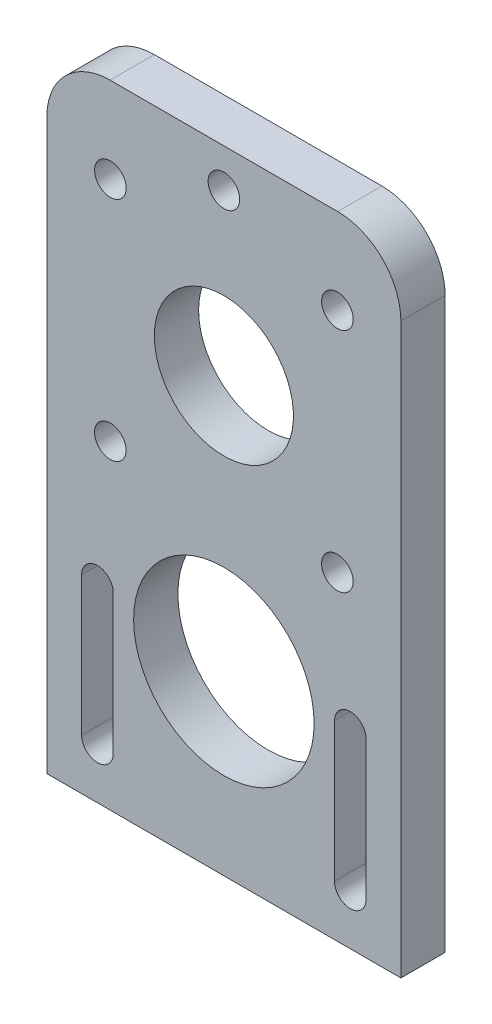
ISO-10303-21;
HEADER;
FILE_DESCRIPTION(('STEP AP214'),'2;1');
FILE_NAME('part.step','',(''),(''),'','','');
FILE_SCHEMA(('AUTOMOTIVE_DESIGN { 1 0 10303 214 1 1 1 1 }'));
ENDSEC;
DATA;
#1=APPLICATION_CONTEXT('core data for automotive mechanical design processes');
#2=APPLICATION_PROTOCOL_DEFINITION('international standard','automotive_design',2000,#1);
#3=PRODUCT_CONTEXT('',#1,'mechanical');
#4=PRODUCT('Part','Part','',(#3));
#5=PRODUCT_RELATED_PRODUCT_CATEGORY('part','',(#4));
#6=PRODUCT_DEFINITION_FORMATION('','',#4);
#7=PRODUCT_DEFINITION_CONTEXT('part definition',#1,'design');
#8=PRODUCT_DEFINITION('design','',#6,#7);
#9=PRODUCT_DEFINITION_SHAPE('','',#8);
#10=(LENGTH_UNIT() NAMED_UNIT(*) SI_UNIT(.MILLI.,.METRE.));
#11=(NAMED_UNIT(*) PLANE_ANGLE_UNIT() SI_UNIT($,.RADIAN.));
#12=(NAMED_UNIT(*) SI_UNIT($,.STERADIAN.) SOLID_ANGLE_UNIT());
#13=UNCERTAINTY_MEASURE_WITH_UNIT(LENGTH_MEASURE(1.E-05),#10,'distance_accuracy_value','');
#14=(GEOMETRIC_REPRESENTATION_CONTEXT(3) GLOBAL_UNCERTAINTY_ASSIGNED_CONTEXT((#13)) GLOBAL_UNIT_ASSIGNED_CONTEXT((#10,
#11,#12)) REPRESENTATION_CONTEXT('',''));
#15=CARTESIAN_POINT('',(0.,0.,0.));
#16=DIRECTION('',(0.,0.,1.));
#17=DIRECTION('',(1.,0.,0.));
#18=AXIS2_PLACEMENT_3D('',#15,#16,#17);
#19=CARTESIAN_POINT('',(0.,0.,7.));
#20=DIRECTION('',(-1.,0.,0.));
#21=DIRECTION('',(0.,0.,1.));
#22=AXIS2_PLACEMENT_3D('',#19,#20,#21);
#23=PLANE('',#22);
#24=DIRECTION('',(0.,1.,0.));
#25=VECTOR('',#24,1.);
#26=CARTESIAN_POINT('',(0.,0.,7.));
#27=LINE('',#26,#25);
#28=CARTESIAN_POINT('',(0.,0.,7.));
#29=VERTEX_POINT('',#28);
#30=CARTESIAN_POINT('',(0.,90.,7.));
#31=VERTEX_POINT('',#30);
#32=EDGE_CURVE('E230',#29,#31,#27,.T.);
#33=ORIENTED_EDGE('',*,*,#32,.T.);
#34=DIRECTION('',(0.,0.,-1.));
#35=VECTOR('',#34,1.);
#36=CARTESIAN_POINT('',(0.,90.,7.));
#37=LINE('',#36,#35);
#38=CARTESIAN_POINT('',(0.,90.,0.));
#39=VERTEX_POINT('',#38);
#40=EDGE_CURVE('E11',#31,#39,#37,.T.);
#41=ORIENTED_EDGE('',*,*,#40,.T.);
#42=DIRECTION('',(0.,1.,0.));
#43=VECTOR('',#42,1.);
#44=CARTESIAN_POINT('',(0.,0.,0.));
#45=LINE('',#44,#43);
#46=CARTESIAN_POINT('',(0.,0.,0.));
#47=VERTEX_POINT('',#46);
#48=EDGE_CURVE('E227',#47,#39,#45,.T.);
#49=ORIENTED_EDGE('',*,*,#48,.F.);
#50=DIRECTION('',(0.,0.,-1.));
#51=VECTOR('',#50,1.);
#52=CARTESIAN_POINT('',(0.,0.,7.));
#53=LINE('',#52,#51);
#54=EDGE_CURVE('E247',#29,#47,#53,.T.);
#55=ORIENTED_EDGE('',*,*,#54,.F.);
#56=EDGE_LOOP('',(#33,#41,#49,#55));
#57=FACE_BOUND('',#56,.T.);
#58=ADVANCED_FACE('F44',(#57),#23,.T.);
#59=CARTESIAN_POINT('',(0.,0.,7.));
#60=DIRECTION('',(0.,1.,0.));
#61=DIRECTION('',(0.,0.,1.));
#62=AXIS2_PLACEMENT_3D('',#59,#60,#61);
#63=PLANE('',#62);
#64=DIRECTION('',(1.,0.,0.));
#65=VECTOR('',#64,1.);
#66=CARTESIAN_POINT('',(0.,0.,0.));
#67=LINE('',#66,#65);
#68=CARTESIAN_POINT('',(56.,0.,0.));
#69=VERTEX_POINT('',#68);
#70=EDGE_CURVE('E235',#47,#69,#67,.T.);
#71=ORIENTED_EDGE('',*,*,#70,.T.);
#72=DIRECTION('',(0.,0.,-1.));
#73=VECTOR('',#72,1.);
#74=CARTESIAN_POINT('',(56.,0.,7.));
#75=LINE('',#74,#73);
#76=CARTESIAN_POINT('',(56.,0.,7.));
#77=VERTEX_POINT('',#76);
#78=EDGE_CURVE('E237',#77,#69,#75,.T.);
#79=ORIENTED_EDGE('',*,*,#78,.F.);
#80=DIRECTION('',(1.,0.,0.));
#81=VECTOR('',#80,1.);
#82=CARTESIAN_POINT('',(0.,0.,7.));
#83=LINE('',#82,#81);
#84=EDGE_CURVE('E240',#29,#77,#83,.T.);
#85=ORIENTED_EDGE('',*,*,#84,.F.);
#86=ORIENTED_EDGE('',*,*,#54,.T.);
#87=EDGE_LOOP('',(#71,#79,#85,#86));
#88=FACE_BOUND('',#87,.T.);
#89=ADVANCED_FACE('F280',(#88),#63,.F.);
#90=CARTESIAN_POINT('',(56.,0.,7.));
#91=DIRECTION('',(-1.,0.,0.));
#92=DIRECTION('',(0.,0.,1.));
#93=AXIS2_PLACEMENT_3D('',#90,#91,#92);
#94=PLANE('',#93);
#95=DIRECTION('',(0.,1.,0.));
#96=VECTOR('',#95,1.);
#97=CARTESIAN_POINT('',(56.,0.,0.));
#98=LINE('',#97,#96);
#99=CARTESIAN_POINT('',(56.,90.,0.));
#100=VERTEX_POINT('',#99);
#101=EDGE_CURVE('E244',#69,#100,#98,.T.);
#102=ORIENTED_EDGE('',*,*,#101,.T.);
#103=DIRECTION('',(0.,0.,-1.));
#104=VECTOR('',#103,1.);
#105=CARTESIAN_POINT('',(56.,90.,7.));
#106=LINE('',#105,#104);
#107=CARTESIAN_POINT('',(56.,90.,7.));
#108=VERTEX_POINT('',#107);
#109=EDGE_CURVE('E68',#100,#108,#106,.F.);
#110=ORIENTED_EDGE('',*,*,#109,.T.);
#111=DIRECTION('',(0.,1.,0.));
#112=VECTOR('',#111,1.);
#113=CARTESIAN_POINT('',(56.,0.,7.));
#114=LINE('',#113,#112);
#115=EDGE_CURVE('E232',#77,#108,#114,.T.);
#116=ORIENTED_EDGE('',*,*,#115,.F.);
#117=ORIENTED_EDGE('',*,*,#78,.T.);
#118=EDGE_LOOP('',(#102,#110,#116,#117));
#119=FACE_BOUND('',#118,.T.);
#120=ADVANCED_FACE('F274',(#119),#94,.F.);
#121=CARTESIAN_POINT('',(0.,100.,7.));
#122=DIRECTION('',(0.,1.,0.));
#123=DIRECTION('',(0.,0.,1.));
#124=AXIS2_PLACEMENT_3D('',#121,#122,#123);
#125=PLANE('',#124);
#126=DIRECTION('',(1.,0.,0.));
#127=VECTOR('',#126,1.);
#128=CARTESIAN_POINT('',(0.,100.,7.));
#129=LINE('',#128,#127);
#130=CARTESIAN_POINT('',(10.,100.,7.));
#131=VERTEX_POINT('',#130);
#132=CARTESIAN_POINT('',(46.,100.,7.));
#133=VERTEX_POINT('',#132);
#134=EDGE_CURVE('E233',#131,#133,#129,.T.);
#135=ORIENTED_EDGE('',*,*,#134,.T.);
#136=DIRECTION('',(0.,0.,-1.));
#137=VECTOR('',#136,1.);
#138=CARTESIAN_POINT('',(46.,100.,0.));
#139=LINE('',#138,#137);
#140=CARTESIAN_POINT('',(46.,100.,0.));
#141=VERTEX_POINT('',#140);
#142=EDGE_CURVE('E251',#133,#141,#139,.T.);
#143=ORIENTED_EDGE('',*,*,#142,.T.);
#144=DIRECTION('',(1.,0.,0.));
#145=VECTOR('',#144,1.);
#146=CARTESIAN_POINT('',(0.,100.,0.));
#147=LINE('',#146,#145);
#148=CARTESIAN_POINT('',(10.,100.,0.));
#149=VERTEX_POINT('',#148);
#150=EDGE_CURVE('E245',#149,#141,#147,.T.);
#151=ORIENTED_EDGE('',*,*,#150,.F.);
#152=DIRECTION('',(0.,0.,-1.));
#153=VECTOR('',#152,1.);
#154=CARTESIAN_POINT('',(10.,100.,7.));
#155=LINE('',#154,#153);
#156=EDGE_CURVE('E249',#149,#131,#155,.F.);
#157=ORIENTED_EDGE('',*,*,#156,.T.);
#158=EDGE_LOOP('',(#135,#143,#151,#157));
#159=FACE_BOUND('',#158,.T.);
#160=ADVANCED_FACE('F267',(#159),#125,.T.);
#161=CARTESIAN_POINT('',(0.,0.,7.));
#162=DIRECTION('',(0.,0.,-1.));
#163=DIRECTION('',(-1.,0.,0.));
#164=AXIS2_PLACEMENT_3D('',#161,#162,#163);
#165=PLANE('',#164);
#166=CARTESIAN_POINT('',(10.0340180617316,50.5449591202412,7.));
#167=DIRECTION('',(0.,0.,-1.));
#168=DIRECTION('',(-1.,0.,0.));
#169=AXIS2_PLACEMENT_3D('',#166,#167,#168);
#170=CIRCLE('',#169,2.5);
#171=CARTESIAN_POINT('',(7.53401806173156,50.5449591202412,7.));
#172=VERTEX_POINT('',#171);
#173=EDGE_CURVE('E391',#172,#172,#170,.T.);
#174=ORIENTED_EDGE('',*,*,#173,.T.);
#175=EDGE_LOOP('',(#174));
#176=FACE_BOUND('',#175,.T.);
#177=CARTESIAN_POINT('',(45.9550408797589,50.5340180617316,7.));
#178=DIRECTION('',(0.,0.,-1.));
#179=DIRECTION('',(-1.,0.,0.));
#180=AXIS2_PLACEMENT_3D('',#177,#178,#179);
#181=CIRCLE('',#180,2.5);
#182=CARTESIAN_POINT('',(43.4550408797589,50.5340180617316,7.));
#183=VERTEX_POINT('',#182);
#184=EDGE_CURVE('E383',#183,#183,#181,.T.);
#185=ORIENTED_EDGE('',*,*,#184,.T.);
#186=EDGE_LOOP('',(#185));
#187=FACE_BOUND('',#186,.T.);
#188=CARTESIAN_POINT('',(10.0449591202411,86.4659819382685,7.));
#189=DIRECTION('',(0.,0.,-1.));
#190=DIRECTION('',(-1.,0.,0.));
#191=AXIS2_PLACEMENT_3D('',#188,#189,#190);
#192=CIRCLE('',#191,2.5);
#193=CARTESIAN_POINT('',(7.54495912024114,86.4659819382685,7.));
#194=VERTEX_POINT('',#193);
#195=EDGE_CURVE('E378',#194,#194,#192,.T.);
#196=ORIENTED_EDGE('',*,*,#195,.T.);
#197=EDGE_LOOP('',(#196));
#198=FACE_BOUND('',#197,.T.);
#199=CARTESIAN_POINT('',(28.0077364966655,93.8999988217838,7.));
#200=DIRECTION('',(0.,0.,-1.));
#201=DIRECTION('',(-1.,0.,0.));
#202=AXIS2_PLACEMENT_3D('',#199,#200,#201);
#203=CIRCLE('',#202,2.5);
#204=CARTESIAN_POINT('',(25.5077364966655,93.8999988217838,7.));
#205=VERTEX_POINT('',#204);
#206=EDGE_CURVE('E364',#205,#205,#203,.T.);
#207=ORIENTED_EDGE('',*,*,#206,.T.);
#208=EDGE_LOOP('',(#207));
#209=FACE_BOUND('',#208,.T.);
#210=CARTESIAN_POINT('',(45.9659819382684,86.4550408797589,7.));
#211=DIRECTION('',(0.,0.,-1.));
#212=DIRECTION('',(-1.,0.,0.));
#213=AXIS2_PLACEMENT_3D('',#210,#211,#212);
#214=CIRCLE('',#213,2.5);
#215=CARTESIAN_POINT('',(43.4659819382684,86.4550408797589,7.));
#216=VERTEX_POINT('',#215);
#217=EDGE_CURVE('E375',#216,#216,#214,.T.);
#218=ORIENTED_EDGE('',*,*,#217,.T.);
#219=EDGE_LOOP('',(#218));
#220=FACE_BOUND('',#219,.T.);
#221=CARTESIAN_POINT('',(28.,68.5,7.));
#222=DIRECTION('',(0.,0.,-1.));
#223=DIRECTION('',(-1.,0.,0.));
#224=AXIS2_PLACEMENT_3D('',#221,#222,#223);
#225=CIRCLE('',#224,11.);
#226=CARTESIAN_POINT('',(17.,68.5,7.));
#227=VERTEX_POINT('',#226);
#228=EDGE_CURVE('E204',#227,#227,#225,.T.);
#229=ORIENTED_EDGE('',*,*,#228,.T.);
#230=EDGE_LOOP('',(#229));
#231=FACE_BOUND('',#230,.T.);
#232=DIRECTION('',(0.,-1.,0.));
#233=VECTOR('',#232,1.);
#234=CARTESIAN_POINT('',(45.5,30.,7.));
#235=LINE('',#234,#233);
#236=CARTESIAN_POINT('',(45.5,30.,7.));
#237=VERTEX_POINT('',#236);
#238=CARTESIAN_POINT('',(45.5,8.,7.));
#239=VERTEX_POINT('',#238);
#240=EDGE_CURVE('E211',#237,#239,#235,.T.);
#241=ORIENTED_EDGE('',*,*,#240,.F.);
#242=CARTESIAN_POINT('',(48.,30.,7.));
#243=DIRECTION('',(0.,0.,1.));
#244=DIRECTION('',(1.,0.,0.));
#245=AXIS2_PLACEMENT_3D('',#242,#243,#244);
#246=CIRCLE('',#245,2.5);
#247=CARTESIAN_POINT('',(50.5,30.,7.));
#248=VERTEX_POINT('',#247);
#249=EDGE_CURVE('E163',#248,#237,#246,.T.);
#250=ORIENTED_EDGE('',*,*,#249,.F.);
#251=DIRECTION('',(0.,1.,0.));
#252=VECTOR('',#251,1.);
#253=CARTESIAN_POINT('',(50.5,30.,7.));
#254=LINE('',#253,#252);
#255=CARTESIAN_POINT('',(50.5,8.,7.));
#256=VERTEX_POINT('',#255);
#257=EDGE_CURVE('E201',#256,#248,#254,.T.);
#258=ORIENTED_EDGE('',*,*,#257,.F.);
#259=CARTESIAN_POINT('',(48.,8.,7.));
#260=DIRECTION('',(0.,0.,1.));
#261=DIRECTION('',(1.,0.,0.));
#262=AXIS2_PLACEMENT_3D('',#259,#260,#261);
#263=CIRCLE('',#262,2.50000000000001);
#264=EDGE_CURVE('E206',#239,#256,#263,.T.);
#265=ORIENTED_EDGE('',*,*,#264,.F.);
#266=EDGE_LOOP('',(#241,#250,#258,#265));
#267=FACE_BOUND('',#266,.T.);
#268=DIRECTION('',(0.,-1.,0.));
#269=VECTOR('',#268,1.);
#270=CARTESIAN_POINT('',(5.5,30.,7.));
#271=LINE('',#270,#269);
#272=CARTESIAN_POINT('',(5.5,30.,7.));
#273=VERTEX_POINT('',#272);
#274=CARTESIAN_POINT('',(5.5,8.,7.));
#275=VERTEX_POINT('',#274);
#276=EDGE_CURVE('E174',#273,#275,#271,.T.);
#277=ORIENTED_EDGE('',*,*,#276,.F.);
#278=CARTESIAN_POINT('',(8.,30.,7.));
#279=DIRECTION('',(0.,0.,1.));
#280=DIRECTION('',(1.,0.,0.));
#281=AXIS2_PLACEMENT_3D('',#278,#279,#280);
#282=CIRCLE('',#281,2.5);
#283=CARTESIAN_POINT('',(10.5,30.,7.));
#284=VERTEX_POINT('',#283);
#285=EDGE_CURVE('E153',#284,#273,#282,.T.);
#286=ORIENTED_EDGE('',*,*,#285,.F.);
#287=DIRECTION('',(0.,1.,0.));
#288=VECTOR('',#287,1.);
#289=CARTESIAN_POINT('',(10.5,30.,7.));
#290=LINE('',#289,#288);
#291=CARTESIAN_POINT('',(10.5,8.,7.));
#292=VERTEX_POINT('',#291);
#293=EDGE_CURVE('E165',#292,#284,#290,.T.);
#294=ORIENTED_EDGE('',*,*,#293,.F.);
#295=CARTESIAN_POINT('',(8.,8.,7.));
#296=DIRECTION('',(0.,0.,1.));
#297=DIRECTION('',(1.,0.,0.));
#298=AXIS2_PLACEMENT_3D('',#295,#296,#297);
#299=CIRCLE('',#298,2.5);
#300=EDGE_CURVE('E169',#275,#292,#299,.T.);
#301=ORIENTED_EDGE('',*,*,#300,.F.);
#302=EDGE_LOOP('',(#277,#286,#294,#301));
#303=FACE_BOUND('',#302,.T.);
#304=CARTESIAN_POINT('',(28.,28.,7.));
#305=DIRECTION('',(0.,0.,1.));
#306=DIRECTION('',(1.,0.,0.));
#307=AXIS2_PLACEMENT_3D('',#304,#305,#306);
#308=CIRCLE('',#307,14.275);
#309=CARTESIAN_POINT('',(42.275,28.,7.));
#310=VERTEX_POINT('',#309);
#311=EDGE_CURVE('E176',#310,#310,#308,.T.);
#312=ORIENTED_EDGE('',*,*,#311,.F.);
#313=EDGE_LOOP('',(#312));
#314=FACE_BOUND('',#313,.T.);
#315=ORIENTED_EDGE('',*,*,#115,.T.);
#316=CARTESIAN_POINT('',(46.,90.,7.));
#317=DIRECTION('',(0.,0.,-1.));
#318=DIRECTION('',(-1.,0.,0.));
#319=AXIS2_PLACEMENT_3D('',#316,#317,#318);
#320=CIRCLE('',#319,10.);
#321=EDGE_CURVE('E52',#108,#133,#320,.F.);
#322=ORIENTED_EDGE('',*,*,#321,.T.);
#323=ORIENTED_EDGE('',*,*,#134,.F.);
#324=CARTESIAN_POINT('',(10.,90.,7.));
#325=DIRECTION('',(0.,0.,-1.));
#326=DIRECTION('',(-1.,0.,0.));
#327=AXIS2_PLACEMENT_3D('',#324,#325,#326);
#328=CIRCLE('',#327,10.);
#329=EDGE_CURVE('E58',#131,#31,#328,.F.);
#330=ORIENTED_EDGE('',*,*,#329,.T.);
#331=ORIENTED_EDGE('',*,*,#32,.F.);
#332=ORIENTED_EDGE('',*,*,#84,.T.);
#333=EDGE_LOOP('',(#315,#322,#323,#330,#331,#332));
#334=FACE_BOUND('',#333,.T.);
#335=ADVANCED_FACE('F175',(#176,#187,#198,#209,#220,#231,#267,#303,#314,#334),#165,.F.);
#336=CARTESIAN_POINT('',(0.,0.,0.));
#337=DIRECTION('',(0.,0.,-1.));
#338=DIRECTION('',(-1.,0.,0.));
#339=AXIS2_PLACEMENT_3D('',#336,#337,#338);
#340=PLANE('',#339);
#341=CARTESIAN_POINT('',(10.0340180617316,50.5449591202412,0.));
#342=DIRECTION('',(0.,0.,-1.));
#343=DIRECTION('',(-1.,0.,0.));
#344=AXIS2_PLACEMENT_3D('',#341,#342,#343);
#345=CIRCLE('',#344,2.5);
#346=CARTESIAN_POINT('',(7.53401806173156,50.5449591202412,0.));
#347=VERTEX_POINT('',#346);
#348=EDGE_CURVE('E390',#347,#347,#345,.T.);
#349=ORIENTED_EDGE('',*,*,#348,.F.);
#350=EDGE_LOOP('',(#349));
#351=FACE_BOUND('',#350,.T.);
#352=CARTESIAN_POINT('',(45.9550408797589,50.5340180617316,0.));
#353=DIRECTION('',(0.,0.,-1.));
#354=DIRECTION('',(-1.,0.,0.));
#355=AXIS2_PLACEMENT_3D('',#352,#353,#354);
#356=CIRCLE('',#355,2.5);
#357=CARTESIAN_POINT('',(43.4550408797589,50.5340180617316,0.));
#358=VERTEX_POINT('',#357);
#359=EDGE_CURVE('E385',#358,#358,#356,.T.);
#360=ORIENTED_EDGE('',*,*,#359,.F.);
#361=EDGE_LOOP('',(#360));
#362=FACE_BOUND('',#361,.T.);
#363=CARTESIAN_POINT('',(10.0449591202411,86.4659819382685,0.));
#364=DIRECTION('',(0.,0.,-1.));
#365=DIRECTION('',(-1.,0.,0.));
#366=AXIS2_PLACEMENT_3D('',#363,#364,#365);
#367=CIRCLE('',#366,2.5);
#368=CARTESIAN_POINT('',(7.54495912024114,86.4659819382685,0.));
#369=VERTEX_POINT('',#368);
#370=EDGE_CURVE('E372',#369,#369,#367,.T.);
#371=ORIENTED_EDGE('',*,*,#370,.F.);
#372=EDGE_LOOP('',(#371));
#373=FACE_BOUND('',#372,.T.);
#374=CARTESIAN_POINT('',(28.0077364966655,93.8999988217838,0.));
#375=DIRECTION('',(0.,0.,-1.));
#376=DIRECTION('',(-1.,0.,0.));
#377=AXIS2_PLACEMENT_3D('',#374,#375,#376);
#378=CIRCLE('',#377,2.5);
#379=CARTESIAN_POINT('',(25.5077364966655,93.8999988217838,0.));
#380=VERTEX_POINT('',#379);
#381=EDGE_CURVE('E370',#380,#380,#378,.T.);
#382=ORIENTED_EDGE('',*,*,#381,.F.);
#383=EDGE_LOOP('',(#382));
#384=FACE_BOUND('',#383,.T.);
#385=CARTESIAN_POINT('',(45.9659819382684,86.4550408797589,0.));
#386=DIRECTION('',(0.,0.,-1.));
#387=DIRECTION('',(-1.,0.,0.));
#388=AXIS2_PLACEMENT_3D('',#385,#386,#387);
#389=CIRCLE('',#388,2.5);
#390=CARTESIAN_POINT('',(43.4659819382684,86.4550408797589,0.));
#391=VERTEX_POINT('',#390);
#392=EDGE_CURVE('E367',#391,#391,#389,.T.);
#393=ORIENTED_EDGE('',*,*,#392,.F.);
#394=EDGE_LOOP('',(#393));
#395=FACE_BOUND('',#394,.T.);
#396=CARTESIAN_POINT('',(28.,68.5,0.));
#397=DIRECTION('',(0.,0.,-1.));
#398=DIRECTION('',(-1.,0.,0.));
#399=AXIS2_PLACEMENT_3D('',#396,#397,#398);
#400=CIRCLE('',#399,11.);
#401=CARTESIAN_POINT('',(17.,68.5,0.));
#402=VERTEX_POINT('',#401);
#403=EDGE_CURVE('E394',#402,#402,#400,.T.);
#404=ORIENTED_EDGE('',*,*,#403,.F.);
#405=EDGE_LOOP('',(#404));
#406=FACE_BOUND('',#405,.T.);
#407=CARTESIAN_POINT('',(48.,30.,0.));
#408=DIRECTION('',(0.,0.,1.));
#409=DIRECTION('',(1.,0.,0.));
#410=AXIS2_PLACEMENT_3D('',#407,#408,#409);
#411=CIRCLE('',#410,2.5);
#412=CARTESIAN_POINT('',(50.5,30.,0.));
#413=VERTEX_POINT('',#412);
#414=CARTESIAN_POINT('',(45.5,30.,0.));
#415=VERTEX_POINT('',#414);
#416=EDGE_CURVE('E209',#413,#415,#411,.T.);
#417=ORIENTED_EDGE('',*,*,#416,.T.);
#418=DIRECTION('',(0.,-1.,0.));
#419=VECTOR('',#418,1.);
#420=CARTESIAN_POINT('',(45.5,30.,0.));
#421=LINE('',#420,#419);
#422=CARTESIAN_POINT('',(45.5,8.,0.));
#423=VERTEX_POINT('',#422);
#424=EDGE_CURVE('E222',#415,#423,#421,.T.);
#425=ORIENTED_EDGE('',*,*,#424,.T.);
#426=CARTESIAN_POINT('',(48.,8.,0.));
#427=DIRECTION('',(0.,0.,1.));
#428=DIRECTION('',(1.,0.,0.));
#429=AXIS2_PLACEMENT_3D('',#426,#427,#428);
#430=CIRCLE('',#429,2.50000000000001);
#431=CARTESIAN_POINT('',(50.5,8.,0.));
#432=VERTEX_POINT('',#431);
#433=EDGE_CURVE('E218',#423,#432,#430,.T.);
#434=ORIENTED_EDGE('',*,*,#433,.T.);
#435=DIRECTION('',(0.,1.,0.));
#436=VECTOR('',#435,1.);
#437=CARTESIAN_POINT('',(50.5,30.,0.));
#438=LINE('',#437,#436);
#439=EDGE_CURVE('E200',#432,#413,#438,.T.);
#440=ORIENTED_EDGE('',*,*,#439,.T.);
#441=EDGE_LOOP('',(#417,#425,#434,#440));
#442=FACE_BOUND('',#441,.T.);
#443=CARTESIAN_POINT('',(8.,30.,0.));
#444=DIRECTION('',(0.,0.,1.));
#445=DIRECTION('',(1.,0.,0.));
#446=AXIS2_PLACEMENT_3D('',#443,#444,#445);
#447=CIRCLE('',#446,2.5);
#448=CARTESIAN_POINT('',(10.5,30.,0.));
#449=VERTEX_POINT('',#448);
#450=CARTESIAN_POINT('',(5.5,30.,0.));
#451=VERTEX_POINT('',#450);
#452=EDGE_CURVE('E157',#449,#451,#447,.T.);
#453=ORIENTED_EDGE('',*,*,#452,.T.);
#454=DIRECTION('',(0.,-1.,0.));
#455=VECTOR('',#454,1.);
#456=CARTESIAN_POINT('',(5.5,30.,0.));
#457=LINE('',#456,#455);
#458=CARTESIAN_POINT('',(5.5,8.,0.));
#459=VERTEX_POINT('',#458);
#460=EDGE_CURVE('E188',#451,#459,#457,.T.);
#461=ORIENTED_EDGE('',*,*,#460,.T.);
#462=CARTESIAN_POINT('',(8.,8.,0.));
#463=DIRECTION('',(0.,0.,1.));
#464=DIRECTION('',(1.,0.,0.));
#465=AXIS2_PLACEMENT_3D('',#462,#463,#464);
#466=CIRCLE('',#465,2.5);
#467=CARTESIAN_POINT('',(10.5,8.,0.));
#468=VERTEX_POINT('',#467);
#469=EDGE_CURVE('E187',#459,#468,#466,.T.);
#470=ORIENTED_EDGE('',*,*,#469,.T.);
#471=DIRECTION('',(0.,1.,0.));
#472=VECTOR('',#471,1.);
#473=CARTESIAN_POINT('',(10.5,30.,0.));
#474=LINE('',#473,#472);
#475=EDGE_CURVE('E183',#468,#449,#474,.T.);
#476=ORIENTED_EDGE('',*,*,#475,.T.);
#477=EDGE_LOOP('',(#453,#461,#470,#476));
#478=FACE_BOUND('',#477,.T.);
#479=CARTESIAN_POINT('',(28.,28.,0.));
#480=DIRECTION('',(0.,0.,1.));
#481=DIRECTION('',(1.,0.,0.));
#482=AXIS2_PLACEMENT_3D('',#479,#480,#481);
#483=CIRCLE('',#482,14.275);
#484=CARTESIAN_POINT('',(42.275,28.,0.));
#485=VERTEX_POINT('',#484);
#486=EDGE_CURVE('E177',#485,#485,#483,.T.);
#487=ORIENTED_EDGE('',*,*,#486,.T.);
#488=EDGE_LOOP('',(#487));
#489=FACE_BOUND('',#488,.T.);
#490=ORIENTED_EDGE('',*,*,#150,.T.);
#491=CARTESIAN_POINT('',(46.,90.,0.));
#492=DIRECTION('',(0.,0.,-1.));
#493=DIRECTION('',(-1.,0.,0.));
#494=AXIS2_PLACEMENT_3D('',#491,#492,#493);
#495=CIRCLE('',#494,10.);
#496=EDGE_CURVE('E258',#141,#100,#495,.T.);
#497=ORIENTED_EDGE('',*,*,#496,.T.);
#498=ORIENTED_EDGE('',*,*,#101,.F.);
#499=ORIENTED_EDGE('',*,*,#70,.F.);
#500=ORIENTED_EDGE('',*,*,#48,.T.);
#501=CARTESIAN_POINT('',(10.,90.,0.));
#502=DIRECTION('',(0.,0.,-1.));
#503=DIRECTION('',(-1.,0.,0.));
#504=AXIS2_PLACEMENT_3D('',#501,#502,#503);
#505=CIRCLE('',#504,10.);
#506=EDGE_CURVE('E256',#39,#149,#505,.T.);
#507=ORIENTED_EDGE('',*,*,#506,.T.);
#508=EDGE_LOOP('',(#490,#497,#498,#499,#500,#507));
#509=FACE_BOUND('',#508,.T.);
#510=ADVANCED_FACE('F275',(#351,#362,#373,#384,#395,#406,#442,#478,#489,#509),#340,.T.);
#511=CARTESIAN_POINT('',(28.,28.,0.));
#512=DIRECTION('',(0.,0.,1.));
#513=DIRECTION('',(1.,0.,0.));
#514=AXIS2_PLACEMENT_3D('',#511,#512,#513);
#515=CYLINDRICAL_SURFACE('',#514,14.275);
#516=ORIENTED_EDGE('',*,*,#486,.F.);
#517=EDGE_LOOP('',(#516));
#518=FACE_BOUND('',#517,.T.);
#519=ORIENTED_EDGE('',*,*,#311,.T.);
#520=EDGE_LOOP('',(#519));
#521=FACE_BOUND('',#520,.T.);
#522=ADVANCED_FACE('F305',(#518,#521),#515,.F.);
#523=CARTESIAN_POINT('',(8.,30.,0.));
#524=DIRECTION('',(0.,0.,1.));
#525=DIRECTION('',(1.,0.,0.));
#526=AXIS2_PLACEMENT_3D('',#523,#524,#525);
#527=CYLINDRICAL_SURFACE('',#526,2.5);
#528=ORIENTED_EDGE('',*,*,#285,.T.);
#529=DIRECTION('',(0.,0.,1.));
#530=VECTOR('',#529,1.);
#531=CARTESIAN_POINT('',(5.5,30.,0.));
#532=LINE('',#531,#530);
#533=EDGE_CURVE('E190',#451,#273,#532,.T.);
#534=ORIENTED_EDGE('',*,*,#533,.F.);
#535=ORIENTED_EDGE('',*,*,#452,.F.);
#536=DIRECTION('',(0.,0.,1.));
#537=VECTOR('',#536,1.);
#538=CARTESIAN_POINT('',(10.5,30.,0.));
#539=LINE('',#538,#537);
#540=EDGE_CURVE('E148',#449,#284,#539,.T.);
#541=ORIENTED_EDGE('',*,*,#540,.T.);
#542=EDGE_LOOP('',(#528,#534,#535,#541));
#543=FACE_BOUND('',#542,.T.);
#544=ADVANCED_FACE('F151',(#543),#527,.F.);
#545=CARTESIAN_POINT('',(10.5,30.,0.));
#546=DIRECTION('',(1.,0.,0.));
#547=DIRECTION('',(0.,1.,0.));
#548=AXIS2_PLACEMENT_3D('',#545,#546,#547);
#549=PLANE('',#548);
#550=ORIENTED_EDGE('',*,*,#293,.T.);
#551=ORIENTED_EDGE('',*,*,#540,.F.);
#552=ORIENTED_EDGE('',*,*,#475,.F.);
#553=DIRECTION('',(0.,0.,1.));
#554=VECTOR('',#553,1.);
#555=CARTESIAN_POINT('',(10.5,8.,0.));
#556=LINE('',#555,#554);
#557=EDGE_CURVE('E156',#468,#292,#556,.T.);
#558=ORIENTED_EDGE('',*,*,#557,.T.);
#559=EDGE_LOOP('',(#550,#551,#552,#558));
#560=FACE_BOUND('',#559,.T.);
#561=ADVANCED_FACE('F164',(#560),#549,.F.);
#562=CARTESIAN_POINT('',(8.,8.,0.));
#563=DIRECTION('',(0.,0.,1.));
#564=DIRECTION('',(1.,0.,0.));
#565=AXIS2_PLACEMENT_3D('',#562,#563,#564);
#566=CYLINDRICAL_SURFACE('',#565,2.5);
#567=ORIENTED_EDGE('',*,*,#300,.T.);
#568=ORIENTED_EDGE('',*,*,#557,.F.);
#569=ORIENTED_EDGE('',*,*,#469,.F.);
#570=DIRECTION('',(0.,0.,1.));
#571=VECTOR('',#570,1.);
#572=CARTESIAN_POINT('',(5.5,8.,0.));
#573=LINE('',#572,#571);
#574=EDGE_CURVE('E405',#459,#275,#573,.T.);
#575=ORIENTED_EDGE('',*,*,#574,.T.);
#576=EDGE_LOOP('',(#567,#568,#569,#575));
#577=FACE_BOUND('',#576,.T.);
#578=ADVANCED_FACE('F329',(#577),#566,.F.);
#579=CARTESIAN_POINT('',(5.5,30.,0.));
#580=DIRECTION('',(-1.,0.,0.));
#581=DIRECTION('',(0.,-1.,0.));
#582=AXIS2_PLACEMENT_3D('',#579,#580,#581);
#583=PLANE('',#582);
#584=ORIENTED_EDGE('',*,*,#276,.T.);
#585=ORIENTED_EDGE('',*,*,#574,.F.);
#586=ORIENTED_EDGE('',*,*,#460,.F.);
#587=ORIENTED_EDGE('',*,*,#533,.T.);
#588=EDGE_LOOP('',(#584,#585,#586,#587));
#589=FACE_BOUND('',#588,.T.);
#590=ADVANCED_FACE('F326',(#589),#583,.F.);
#591=CARTESIAN_POINT('',(48.,30.,0.));
#592=DIRECTION('',(0.,0.,1.));
#593=DIRECTION('',(1.,0.,0.));
#594=AXIS2_PLACEMENT_3D('',#591,#592,#593);
#595=CYLINDRICAL_SURFACE('',#594,2.5);
#596=ORIENTED_EDGE('',*,*,#249,.T.);
#597=DIRECTION('',(0.,0.,1.));
#598=VECTOR('',#597,1.);
#599=CARTESIAN_POINT('',(45.5,30.,0.));
#600=LINE('',#599,#598);
#601=EDGE_CURVE('E193',#415,#237,#600,.T.);
#602=ORIENTED_EDGE('',*,*,#601,.F.);
#603=ORIENTED_EDGE('',*,*,#416,.F.);
#604=DIRECTION('',(0.,0.,1.));
#605=VECTOR('',#604,1.);
#606=CARTESIAN_POINT('',(50.5,30.,0.));
#607=LINE('',#606,#605);
#608=EDGE_CURVE('E205',#413,#248,#607,.T.);
#609=ORIENTED_EDGE('',*,*,#608,.T.);
#610=EDGE_LOOP('',(#596,#602,#603,#609));
#611=FACE_BOUND('',#610,.T.);
#612=ADVANCED_FACE('F313',(#611),#595,.F.);
#613=CARTESIAN_POINT('',(50.5,30.,0.));
#614=DIRECTION('',(1.,0.,0.));
#615=DIRECTION('',(0.,1.,0.));
#616=AXIS2_PLACEMENT_3D('',#613,#614,#615);
#617=PLANE('',#616);
#618=ORIENTED_EDGE('',*,*,#257,.T.);
#619=ORIENTED_EDGE('',*,*,#608,.F.);
#620=ORIENTED_EDGE('',*,*,#439,.F.);
#621=DIRECTION('',(0.,0.,1.));
#622=VECTOR('',#621,1.);
#623=CARTESIAN_POINT('',(50.5,8.,0.));
#624=LINE('',#623,#622);
#625=EDGE_CURVE('E199',#432,#256,#624,.T.);
#626=ORIENTED_EDGE('',*,*,#625,.T.);
#627=EDGE_LOOP('',(#618,#619,#620,#626));
#628=FACE_BOUND('',#627,.T.);
#629=ADVANCED_FACE('F309',(#628),#617,.F.);
#630=CARTESIAN_POINT('',(48.,8.,0.));
#631=DIRECTION('',(0.,0.,1.));
#632=DIRECTION('',(1.,0.,0.));
#633=AXIS2_PLACEMENT_3D('',#630,#631,#632);
#634=CYLINDRICAL_SURFACE('',#633,2.50000000000001);
#635=ORIENTED_EDGE('',*,*,#264,.T.);
#636=ORIENTED_EDGE('',*,*,#625,.F.);
#637=ORIENTED_EDGE('',*,*,#433,.F.);
#638=DIRECTION('',(0.,0.,1.));
#639=VECTOR('',#638,1.);
#640=CARTESIAN_POINT('',(45.5,8.,0.));
#641=LINE('',#640,#639);
#642=EDGE_CURVE('E198',#423,#239,#641,.T.);
#643=ORIENTED_EDGE('',*,*,#642,.T.);
#644=EDGE_LOOP('',(#635,#636,#637,#643));
#645=FACE_BOUND('',#644,.T.);
#646=ADVANCED_FACE('F312',(#645),#634,.F.);
#647=CARTESIAN_POINT('',(45.5,30.,0.));
#648=DIRECTION('',(-1.,0.,0.));
#649=DIRECTION('',(0.,-1.,0.));
#650=AXIS2_PLACEMENT_3D('',#647,#648,#649);
#651=PLANE('',#650);
#652=ORIENTED_EDGE('',*,*,#240,.T.);
#653=ORIENTED_EDGE('',*,*,#642,.F.);
#654=ORIENTED_EDGE('',*,*,#424,.F.);
#655=ORIENTED_EDGE('',*,*,#601,.T.);
#656=EDGE_LOOP('',(#652,#653,#654,#655));
#657=FACE_BOUND('',#656,.T.);
#658=ADVANCED_FACE('F319',(#657),#651,.F.);
#659=CARTESIAN_POINT('',(28.,68.5,10.));
#660=DIRECTION('',(0.,0.,-1.));
#661=DIRECTION('',(-1.,0.,0.));
#662=AXIS2_PLACEMENT_3D('',#659,#660,#661);
#663=CYLINDRICAL_SURFACE('',#662,11.);
#664=ORIENTED_EDGE('',*,*,#403,.T.);
#665=EDGE_LOOP('',(#664));
#666=FACE_BOUND('',#665,.T.);
#667=ORIENTED_EDGE('',*,*,#228,.F.);
#668=EDGE_LOOP('',(#667));
#669=FACE_BOUND('',#668,.T.);
#670=ADVANCED_FACE('F321',(#666,#669),#663,.F.);
#671=CARTESIAN_POINT('',(45.9659819382684,86.4550408797589,7.));
#672=DIRECTION('',(0.,0.,-1.));
#673=DIRECTION('',(-1.,0.,0.));
#674=AXIS2_PLACEMENT_3D('',#671,#672,#673);
#675=CYLINDRICAL_SURFACE('',#674,2.5);
#676=ORIENTED_EDGE('',*,*,#217,.F.);
#677=EDGE_LOOP('',(#676));
#678=FACE_BOUND('',#677,.T.);
#679=ORIENTED_EDGE('',*,*,#392,.T.);
#680=EDGE_LOOP('',(#679));
#681=FACE_BOUND('',#680,.T.);
#682=ADVANCED_FACE('F344',(#678,#681),#675,.F.);
#683=CARTESIAN_POINT('',(28.0077364966655,93.8999988217838,7.));
#684=DIRECTION('',(0.,0.,-1.));
#685=DIRECTION('',(-1.,0.,0.));
#686=AXIS2_PLACEMENT_3D('',#683,#684,#685);
#687=CYLINDRICAL_SURFACE('',#686,2.5);
#688=ORIENTED_EDGE('',*,*,#206,.F.);
#689=EDGE_LOOP('',(#688));
#690=FACE_BOUND('',#689,.T.);
#691=ORIENTED_EDGE('',*,*,#381,.T.);
#692=EDGE_LOOP('',(#691));
#693=FACE_BOUND('',#692,.T.);
#694=ADVANCED_FACE('F342',(#690,#693),#687,.F.);
#695=CARTESIAN_POINT('',(10.0449591202411,86.4659819382685,7.));
#696=DIRECTION('',(0.,0.,-1.));
#697=DIRECTION('',(-1.,0.,0.));
#698=AXIS2_PLACEMENT_3D('',#695,#696,#697);
#699=CYLINDRICAL_SURFACE('',#698,2.5);
#700=ORIENTED_EDGE('',*,*,#195,.F.);
#701=EDGE_LOOP('',(#700));
#702=FACE_BOUND('',#701,.T.);
#703=ORIENTED_EDGE('',*,*,#370,.T.);
#704=EDGE_LOOP('',(#703));
#705=FACE_BOUND('',#704,.T.);
#706=ADVANCED_FACE('F355',(#702,#705),#699,.F.);
#707=CARTESIAN_POINT('',(45.9550408797589,50.5340180617316,7.));
#708=DIRECTION('',(0.,0.,-1.));
#709=DIRECTION('',(-1.,0.,0.));
#710=AXIS2_PLACEMENT_3D('',#707,#708,#709);
#711=CYLINDRICAL_SURFACE('',#710,2.5);
#712=ORIENTED_EDGE('',*,*,#184,.F.);
#713=EDGE_LOOP('',(#712));
#714=FACE_BOUND('',#713,.T.);
#715=ORIENTED_EDGE('',*,*,#359,.T.);
#716=EDGE_LOOP('',(#715));
#717=FACE_BOUND('',#716,.T.);
#718=ADVANCED_FACE('F348',(#714,#717),#711,.F.);
#719=CARTESIAN_POINT('',(10.0340180617316,50.5449591202412,7.));
#720=DIRECTION('',(0.,0.,-1.));
#721=DIRECTION('',(-1.,0.,0.));
#722=AXIS2_PLACEMENT_3D('',#719,#720,#721);
#723=CYLINDRICAL_SURFACE('',#722,2.5);
#724=ORIENTED_EDGE('',*,*,#173,.F.);
#725=EDGE_LOOP('',(#724));
#726=FACE_BOUND('',#725,.T.);
#727=ORIENTED_EDGE('',*,*,#348,.T.);
#728=EDGE_LOOP('',(#727));
#729=FACE_BOUND('',#728,.T.);
#730=ADVANCED_FACE('F290',(#726,#729),#723,.F.);
#731=CARTESIAN_POINT('',(46.,90.,7.));
#732=DIRECTION('',(0.,0.,1.));
#733=DIRECTION('',(1.,0.,0.));
#734=AXIS2_PLACEMENT_3D('',#731,#732,#733);
#735=CYLINDRICAL_SURFACE('',#734,10.);
#736=ORIENTED_EDGE('',*,*,#321,.F.);
#737=ORIENTED_EDGE('',*,*,#109,.F.);
#738=ORIENTED_EDGE('',*,*,#496,.F.);
#739=ORIENTED_EDGE('',*,*,#142,.F.);
#740=EDGE_LOOP('',(#736,#737,#738,#739));
#741=FACE_BOUND('',#740,.T.);
#742=ADVANCED_FACE('F269',(#741),#735,.T.);
#743=CARTESIAN_POINT('',(10.,90.,7.));
#744=DIRECTION('',(0.,0.,-1.));
#745=DIRECTION('',(-1.,0.,0.));
#746=AXIS2_PLACEMENT_3D('',#743,#744,#745);
#747=CYLINDRICAL_SURFACE('',#746,10.);
#748=ORIENTED_EDGE('',*,*,#329,.F.);
#749=ORIENTED_EDGE('',*,*,#156,.F.);
#750=ORIENTED_EDGE('',*,*,#506,.F.);
#751=ORIENTED_EDGE('',*,*,#40,.F.);
#752=EDGE_LOOP('',(#748,#749,#750,#751));
#753=FACE_BOUND('',#752,.T.);
#754=ADVANCED_FACE('F50',(#753),#747,.T.);
#755=CLOSED_SHELL('',(#58,#89,#120,#160,#335,#510,#522,#544,#561,#578,#590,#612,#629,#646,#658,
#670,#682,#694,#706,#718,#730,#742,#754));
#756=MANIFOLD_SOLID_BREP('B2',#755);
#757=ADVANCED_BREP_SHAPE_REPRESENTATION('',(#18,#756),#14);
#758=SHAPE_DEFINITION_REPRESENTATION(#9,#757);
ENDSEC;
END-ISO-10303-21;
